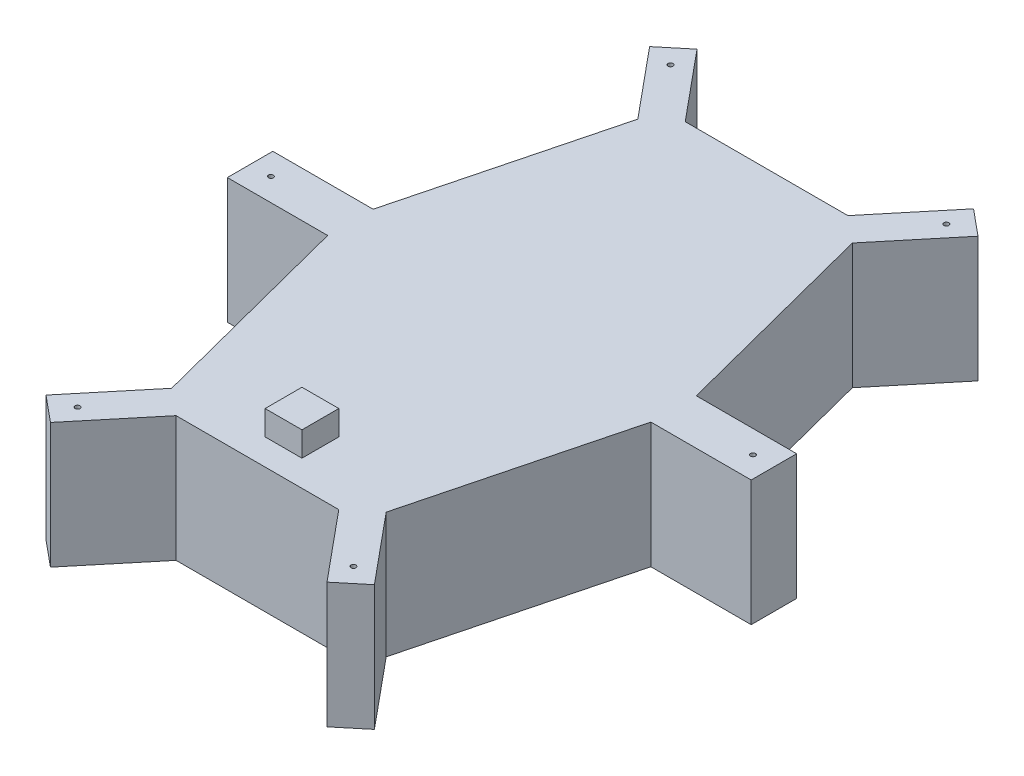
ISO-10303-21;
HEADER;
FILE_DESCRIPTION(('STEP AP214'),'2;1');
FILE_NAME('part.step','',(''),(''),'','','');
FILE_SCHEMA(('AUTOMOTIVE_DESIGN { 1 0 10303 214 1 1 1 1 }'));
ENDSEC;
DATA;
#1=APPLICATION_CONTEXT('core data for automotive mechanical design processes');
#2=APPLICATION_PROTOCOL_DEFINITION('international standard','automotive_design',2000,#1);
#3=PRODUCT_CONTEXT('',#1,'mechanical');
#4=PRODUCT('Part','Part','',(#3));
#5=PRODUCT_RELATED_PRODUCT_CATEGORY('part','',(#4));
#6=PRODUCT_DEFINITION_FORMATION('','',#4);
#7=PRODUCT_DEFINITION_CONTEXT('part definition',#1,'design');
#8=PRODUCT_DEFINITION('design','',#6,#7);
#9=PRODUCT_DEFINITION_SHAPE('','',#8);
#10=(LENGTH_UNIT() NAMED_UNIT(*) SI_UNIT(.MILLI.,.METRE.));
#11=(NAMED_UNIT(*) PLANE_ANGLE_UNIT() SI_UNIT($,.RADIAN.));
#12=(NAMED_UNIT(*) SI_UNIT($,.STERADIAN.) SOLID_ANGLE_UNIT());
#13=UNCERTAINTY_MEASURE_WITH_UNIT(LENGTH_MEASURE(1.E-05),#10,'distance_accuracy_value','');
#14=(GEOMETRIC_REPRESENTATION_CONTEXT(3) GLOBAL_UNCERTAINTY_ASSIGNED_CONTEXT((#13)) GLOBAL_UNIT_ASSIGNED_CONTEXT((#10,
#11,#12)) REPRESENTATION_CONTEXT('',''));
#15=CARTESIAN_POINT('',(0.,0.,0.));
#16=DIRECTION('',(0.,0.,1.));
#17=DIRECTION('',(1.,0.,0.));
#18=AXIS2_PLACEMENT_3D('',#15,#16,#17);
#19=CARTESIAN_POINT('',(-56.259562051727,51.,131.538708790527));
#20=DIRECTION('',(-0.770072992700726,0.,-0.637955786801051));
#21=DIRECTION('',(-0.637955786801051,0.,0.770072992700726));
#22=AXIS2_PLACEMENT_3D('',#19,#20,#21);
#23=PLANE('',#22);
#24=DIRECTION('',(0.63795578680105,0.,-0.770072992700726));
#25=VECTOR('',#24,1.);
#26=CARTESIAN_POINT('',(-56.259562051727,0.,131.538708790527));
#27=LINE('',#26,#25);
#28=CARTESIAN_POINT('',(-56.259562051727,0.,131.538708790527));
#29=VERTEX_POINT('',#28);
#30=CARTESIAN_POINT('',(-33.1,0.,103.582926230358));
#31=VERTEX_POINT('',#30);
#32=EDGE_CURVE('E318',#29,#31,#27,.T.);
#33=ORIENTED_EDGE('',*,*,#32,.T.);
#34=DIRECTION('',(0.,-1.,0.));
#35=VECTOR('',#34,1.);
#36=CARTESIAN_POINT('',(-33.1,51.,103.582926230358));
#37=LINE('',#36,#35);
#38=CARTESIAN_POINT('',(-33.1,51.,103.582926230358));
#39=VERTEX_POINT('',#38);
#40=EDGE_CURVE('E11',#39,#31,#37,.T.);
#41=ORIENTED_EDGE('',*,*,#40,.F.);
#42=DIRECTION('',(0.63795578680105,0.,-0.770072992700726));
#43=VECTOR('',#42,1.);
#44=CARTESIAN_POINT('',(-56.259562051727,51.,131.538708790527));
#45=LINE('',#44,#43);
#46=CARTESIAN_POINT('',(-56.259562051727,51.,131.538708790527));
#47=VERTEX_POINT('',#46);
#48=EDGE_CURVE('E322',#47,#39,#45,.T.);
#49=ORIENTED_EDGE('',*,*,#48,.F.);
#50=DIRECTION('',(0.,-1.,0.));
#51=VECTOR('',#50,1.);
#52=CARTESIAN_POINT('',(-56.259562051727,51.,131.538708790527));
#53=LINE('',#52,#51);
#54=EDGE_CURVE('E405',#47,#29,#53,.T.);
#55=ORIENTED_EDGE('',*,*,#54,.T.);
#56=EDGE_LOOP('',(#33,#41,#49,#55));
#57=FACE_BOUND('',#56,.T.);
#58=ADVANCED_FACE('F39',(#57),#23,.F.);
#59=CARTESIAN_POINT('',(-33.1,51.,103.582926230358));
#60=DIRECTION('',(0.,0.,-1.));
#61=DIRECTION('',(-1.,0.,0.));
#62=AXIS2_PLACEMENT_3D('',#59,#60,#61);
#63=PLANE('',#62);
#64=DIRECTION('',(1.,0.,0.));
#65=VECTOR('',#64,1.);
#66=CARTESIAN_POINT('',(-33.1,0.,103.582926230358));
#67=LINE('',#66,#65);
#68=CARTESIAN_POINT('',(33.1,0.,103.582926230358));
#69=VERTEX_POINT('',#68);
#70=EDGE_CURVE('E409',#31,#69,#67,.T.);
#71=ORIENTED_EDGE('',*,*,#70,.T.);
#72=DIRECTION('',(0.,-1.,0.));
#73=VECTOR('',#72,1.);
#74=CARTESIAN_POINT('',(33.1,51.,103.582926230358));
#75=LINE('',#74,#73);
#76=CARTESIAN_POINT('',(33.1,51.,103.582926230358));
#77=VERTEX_POINT('',#76);
#78=EDGE_CURVE('E47',#77,#69,#75,.T.);
#79=ORIENTED_EDGE('',*,*,#78,.F.);
#80=DIRECTION('',(1.,0.,0.));
#81=VECTOR('',#80,1.);
#82=CARTESIAN_POINT('',(-33.1,51.,103.582926230358));
#83=LINE('',#82,#81);
#84=EDGE_CURVE('E326',#39,#77,#83,.T.);
#85=ORIENTED_EDGE('',*,*,#84,.F.);
#86=ORIENTED_EDGE('',*,*,#40,.T.);
#87=EDGE_LOOP('',(#71,#79,#85,#86));
#88=FACE_BOUND('',#87,.T.);
#89=ADVANCED_FACE('F571',(#88),#63,.F.);
#90=CARTESIAN_POINT('',(56.259562051727,51.,131.538708790527));
#91=DIRECTION('',(-0.770072992700727,0.,0.63795578680105));
#92=DIRECTION('',(0.63795578680105,0.,0.770072992700727));
#93=AXIS2_PLACEMENT_3D('',#90,#91,#92);
#94=PLANE('',#93);
#95=DIRECTION('',(-0.63795578680105,0.,-0.770072992700727));
#96=VECTOR('',#95,1.);
#97=CARTESIAN_POINT('',(56.259562051727,0.,131.538708790527));
#98=LINE('',#97,#96);
#99=CARTESIAN_POINT('',(56.259562051727,0.,131.538708790527));
#100=VERTEX_POINT('',#99);
#101=EDGE_CURVE('E413',#100,#69,#98,.T.);
#102=ORIENTED_EDGE('',*,*,#101,.F.);
#103=DIRECTION('',(0.,-1.,0.));
#104=VECTOR('',#103,1.);
#105=CARTESIAN_POINT('',(56.259562051727,51.,131.538708790527));
#106=LINE('',#105,#104);
#107=CARTESIAN_POINT('',(56.259562051727,51.,131.538708790527));
#108=VERTEX_POINT('',#107);
#109=EDGE_CURVE('E562',#108,#100,#106,.T.);
#110=ORIENTED_EDGE('',*,*,#109,.F.);
#111=DIRECTION('',(-0.63795578680105,0.,-0.770072992700727));
#112=VECTOR('',#111,1.);
#113=CARTESIAN_POINT('',(56.259562051727,51.,131.538708790527));
#114=LINE('',#113,#112);
#115=EDGE_CURVE('E330',#108,#77,#114,.T.);
#116=ORIENTED_EDGE('',*,*,#115,.T.);
#117=ORIENTED_EDGE('',*,*,#78,.T.);
#118=EDGE_LOOP('',(#102,#110,#116,#117));
#119=FACE_BOUND('',#118,.T.);
#120=ADVANCED_FACE('F568',(#119),#94,.T.);
#121=CARTESIAN_POINT('',(66.809562051727,51.,122.798714511353));
#122=DIRECTION('',(0.637955786801052,0.,0.770072992700725));
#123=DIRECTION('',(0.770072992700725,0.,-0.637955786801052));
#124=AXIS2_PLACEMENT_3D('',#121,#122,#123);
#125=PLANE('',#124);
#126=DIRECTION('',(-0.770072992700725,0.,0.637955786801052));
#127=VECTOR('',#126,1.);
#128=CARTESIAN_POINT('',(66.809562051727,0.,122.798714511353));
#129=LINE('',#128,#127);
#130=CARTESIAN_POINT('',(66.809562051727,0.,122.798714511353));
#131=VERTEX_POINT('',#130);
#132=EDGE_CURVE('E417',#131,#100,#129,.T.);
#133=ORIENTED_EDGE('',*,*,#132,.F.);
#134=DIRECTION('',(0.,-1.,0.));
#135=VECTOR('',#134,1.);
#136=CARTESIAN_POINT('',(66.809562051727,51.,122.798714511353));
#137=LINE('',#136,#135);
#138=CARTESIAN_POINT('',(66.809562051727,51.,122.798714511353));
#139=VERTEX_POINT('',#138);
#140=EDGE_CURVE('E559',#139,#131,#137,.T.);
#141=ORIENTED_EDGE('',*,*,#140,.F.);
#142=DIRECTION('',(-0.770072992700725,0.,0.637955786801052));
#143=VECTOR('',#142,1.);
#144=CARTESIAN_POINT('',(66.809562051727,51.,122.798714511353));
#145=LINE('',#144,#143);
#146=EDGE_CURVE('E334',#139,#108,#145,.T.);
#147=ORIENTED_EDGE('',*,*,#146,.T.);
#148=ORIENTED_EDGE('',*,*,#109,.T.);
#149=EDGE_LOOP('',(#133,#141,#147,#148));
#150=FACE_BOUND('',#149,.T.);
#151=ADVANCED_FACE('F580',(#150),#125,.T.);
#152=CARTESIAN_POINT('',(43.65,51.,94.8429319511839));
#153=DIRECTION('',(0.770072992700727,0.,-0.63795578680105));
#154=DIRECTION('',(-0.63795578680105,0.,-0.770072992700727));
#155=AXIS2_PLACEMENT_3D('',#152,#153,#154);
#156=PLANE('',#155);
#157=DIRECTION('',(0.63795578680105,0.,0.770072992700727));
#158=VECTOR('',#157,1.);
#159=CARTESIAN_POINT('',(43.65,0.,94.8429319511839));
#160=LINE('',#159,#158);
#161=CARTESIAN_POINT('',(43.65,0.,94.8429319511839));
#162=VERTEX_POINT('',#161);
#163=EDGE_CURVE('E421',#162,#131,#160,.T.);
#164=ORIENTED_EDGE('',*,*,#163,.F.);
#165=DIRECTION('',(0.,-1.,0.));
#166=VECTOR('',#165,1.);
#167=CARTESIAN_POINT('',(43.65,51.,94.8429319511839));
#168=LINE('',#167,#166);
#169=CARTESIAN_POINT('',(43.65,51.,94.8429319511839));
#170=VERTEX_POINT('',#169);
#171=EDGE_CURVE('E556',#170,#162,#168,.T.);
#172=ORIENTED_EDGE('',*,*,#171,.F.);
#173=DIRECTION('',(0.63795578680105,0.,0.770072992700727));
#174=VECTOR('',#173,1.);
#175=CARTESIAN_POINT('',(43.65,51.,94.8429319511839));
#176=LINE('',#175,#174);
#177=EDGE_CURVE('E338',#170,#139,#176,.T.);
#178=ORIENTED_EDGE('',*,*,#177,.T.);
#179=ORIENTED_EDGE('',*,*,#140,.T.);
#180=EDGE_LOOP('',(#164,#172,#178,#179));
#181=FACE_BOUND('',#180,.T.);
#182=ADVANCED_FACE('F675',(#181),#156,.T.);
#183=CARTESIAN_POINT('',(43.65,51.,94.8429319511839));
#184=DIRECTION('',(-0.968245836551854,0.,-0.25));
#185=DIRECTION('',(-0.25,0.,0.968245836551854));
#186=AXIS2_PLACEMENT_3D('',#183,#184,#185);
#187=PLANE('',#186);
#188=DIRECTION('',(0.25,0.,-0.968245836551854));
#189=VECTOR('',#188,1.);
#190=CARTESIAN_POINT('',(43.65,0.,94.8429319511839));
#191=LINE('',#190,#189);
#192=CARTESIAN_POINT('',(65.75,0.,9.25));
#193=VERTEX_POINT('',#192);
#194=EDGE_CURVE('E425',#162,#193,#191,.T.);
#195=ORIENTED_EDGE('',*,*,#194,.T.);
#196=DIRECTION('',(0.,-1.,0.));
#197=VECTOR('',#196,1.);
#198=CARTESIAN_POINT('',(65.75,51.,9.25));
#199=LINE('',#198,#197);
#200=CARTESIAN_POINT('',(65.75,51.,9.25));
#201=VERTEX_POINT('',#200);
#202=EDGE_CURVE('E552',#201,#193,#199,.T.);
#203=ORIENTED_EDGE('',*,*,#202,.F.);
#204=DIRECTION('',(0.25,0.,-0.968245836551854));
#205=VECTOR('',#204,1.);
#206=CARTESIAN_POINT('',(43.65,51.,94.8429319511839));
#207=LINE('',#206,#205);
#208=EDGE_CURVE('E342',#170,#201,#207,.T.);
#209=ORIENTED_EDGE('',*,*,#208,.F.);
#210=ORIENTED_EDGE('',*,*,#171,.T.);
#211=EDGE_LOOP('',(#195,#203,#209,#210));
#212=FACE_BOUND('',#211,.T.);
#213=ADVANCED_FACE('F673',(#212),#187,.F.);
#214=CARTESIAN_POINT('',(65.75,51.,9.25));
#215=DIRECTION('',(0.,0.,-1.));
#216=DIRECTION('',(-1.,0.,0.));
#217=AXIS2_PLACEMENT_3D('',#214,#215,#216);
#218=PLANE('',#217);
#219=DIRECTION('',(1.,0.,0.));
#220=VECTOR('',#219,1.);
#221=CARTESIAN_POINT('',(65.75,0.,9.25));
#222=LINE('',#221,#220);
#223=CARTESIAN_POINT('',(106.567585168372,0.,9.24999999999997));
#224=VERTEX_POINT('',#223);
#225=EDGE_CURVE('E428',#193,#224,#222,.T.);
#226=ORIENTED_EDGE('',*,*,#225,.T.);
#227=DIRECTION('',(0.,-1.,0.));
#228=VECTOR('',#227,1.);
#229=CARTESIAN_POINT('',(106.567585168372,51.,9.24999999999997));
#230=LINE('',#229,#228);
#231=CARTESIAN_POINT('',(106.567585168372,51.,9.24999999999997));
#232=VERTEX_POINT('',#231);
#233=EDGE_CURVE('E549',#232,#224,#230,.T.);
#234=ORIENTED_EDGE('',*,*,#233,.F.);
#235=DIRECTION('',(1.,0.,0.));
#236=VECTOR('',#235,1.);
#237=CARTESIAN_POINT('',(65.75,51.,9.25));
#238=LINE('',#237,#236);
#239=EDGE_CURVE('E345',#201,#232,#238,.T.);
#240=ORIENTED_EDGE('',*,*,#239,.F.);
#241=ORIENTED_EDGE('',*,*,#202,.T.);
#242=EDGE_LOOP('',(#226,#234,#240,#241));
#243=FACE_BOUND('',#242,.T.);
#244=ADVANCED_FACE('F668',(#243),#218,.F.);
#245=CARTESIAN_POINT('',(106.567585168372,51.,-9.25000000000005));
#246=DIRECTION('',(1.,0.,0.));
#247=DIRECTION('',(0.,0.,-1.));
#248=AXIS2_PLACEMENT_3D('',#245,#246,#247);
#249=PLANE('',#248);
#250=DIRECTION('',(0.,0.,1.));
#251=VECTOR('',#250,1.);
#252=CARTESIAN_POINT('',(106.567585168372,0.,-9.25000000000005));
#253=LINE('',#252,#251);
#254=CARTESIAN_POINT('',(106.567585168372,0.,-9.25000000000005));
#255=VERTEX_POINT('',#254);
#256=EDGE_CURVE('E432',#255,#224,#253,.T.);
#257=ORIENTED_EDGE('',*,*,#256,.F.);
#258=DIRECTION('',(0.,-1.,0.));
#259=VECTOR('',#258,1.);
#260=CARTESIAN_POINT('',(106.567585168372,51.,-9.25000000000005));
#261=LINE('',#260,#259);
#262=CARTESIAN_POINT('',(106.567585168372,51.,-9.25000000000005));
#263=VERTEX_POINT('',#262);
#264=EDGE_CURVE('E546',#263,#255,#261,.T.);
#265=ORIENTED_EDGE('',*,*,#264,.F.);
#266=DIRECTION('',(0.,0.,1.));
#267=VECTOR('',#266,1.);
#268=CARTESIAN_POINT('',(106.567585168372,51.,-9.25000000000005));
#269=LINE('',#268,#267);
#270=EDGE_CURVE('E348',#263,#232,#269,.T.);
#271=ORIENTED_EDGE('',*,*,#270,.T.);
#272=ORIENTED_EDGE('',*,*,#233,.T.);
#273=EDGE_LOOP('',(#257,#265,#271,#272));
#274=FACE_BOUND('',#273,.T.);
#275=ADVANCED_FACE('F664',(#274),#249,.T.);
#276=CARTESIAN_POINT('',(65.75,51.,-9.25000000000002));
#277=DIRECTION('',(0.,0.,-1.));
#278=DIRECTION('',(-1.,0.,0.));
#279=AXIS2_PLACEMENT_3D('',#276,#277,#278);
#280=PLANE('',#279);
#281=DIRECTION('',(1.,0.,0.));
#282=VECTOR('',#281,1.);
#283=CARTESIAN_POINT('',(65.75,0.,-9.25000000000002));
#284=LINE('',#283,#282);
#285=CARTESIAN_POINT('',(65.75,0.,-9.25000000000002));
#286=VERTEX_POINT('',#285);
#287=EDGE_CURVE('E436',#286,#255,#284,.T.);
#288=ORIENTED_EDGE('',*,*,#287,.F.);
#289=DIRECTION('',(0.,-1.,0.));
#290=VECTOR('',#289,1.);
#291=CARTESIAN_POINT('',(65.75,51.,-9.25000000000002));
#292=LINE('',#291,#290);
#293=CARTESIAN_POINT('',(65.75,51.,-9.25000000000002));
#294=VERTEX_POINT('',#293);
#295=EDGE_CURVE('E543',#294,#286,#292,.T.);
#296=ORIENTED_EDGE('',*,*,#295,.F.);
#297=DIRECTION('',(1.,0.,0.));
#298=VECTOR('',#297,1.);
#299=CARTESIAN_POINT('',(65.75,51.,-9.25000000000002));
#300=LINE('',#299,#298);
#301=EDGE_CURVE('E352',#294,#263,#300,.T.);
#302=ORIENTED_EDGE('',*,*,#301,.T.);
#303=ORIENTED_EDGE('',*,*,#264,.T.);
#304=EDGE_LOOP('',(#288,#296,#302,#303));
#305=FACE_BOUND('',#304,.T.);
#306=ADVANCED_FACE('F658',(#305),#280,.T.);
#307=CARTESIAN_POINT('',(65.75,51.,-9.25000000000002));
#308=DIRECTION('',(-0.968245836551854,0.,0.25));
#309=DIRECTION('',(0.25,0.,0.968245836551854));
#310=AXIS2_PLACEMENT_3D('',#307,#308,#309);
#311=PLANE('',#310);
#312=DIRECTION('',(-0.25,0.,-0.968245836551854));
#313=VECTOR('',#312,1.);
#314=CARTESIAN_POINT('',(65.75,0.,-9.25000000000002));
#315=LINE('',#314,#313);
#316=CARTESIAN_POINT('',(43.65,0.,-94.8429319511839));
#317=VERTEX_POINT('',#316);
#318=EDGE_CURVE('E440',#286,#317,#315,.T.);
#319=ORIENTED_EDGE('',*,*,#318,.T.);
#320=DIRECTION('',(0.,-1.,0.));
#321=VECTOR('',#320,1.);
#322=CARTESIAN_POINT('',(43.65,51.,-94.8429319511839));
#323=LINE('',#322,#321);
#324=CARTESIAN_POINT('',(43.65,51.,-94.8429319511839));
#325=VERTEX_POINT('',#324);
#326=EDGE_CURVE('E539',#325,#317,#323,.T.);
#327=ORIENTED_EDGE('',*,*,#326,.F.);
#328=DIRECTION('',(-0.25,0.,-0.968245836551854));
#329=VECTOR('',#328,1.);
#330=CARTESIAN_POINT('',(65.75,51.,-9.25000000000002));
#331=LINE('',#330,#329);
#332=EDGE_CURVE('E356',#294,#325,#331,.T.);
#333=ORIENTED_EDGE('',*,*,#332,.F.);
#334=ORIENTED_EDGE('',*,*,#295,.T.);
#335=EDGE_LOOP('',(#319,#327,#333,#334));
#336=FACE_BOUND('',#335,.T.);
#337=ADVANCED_FACE('F676',(#336),#311,.F.);
#338=CARTESIAN_POINT('',(43.65,51.,-94.8429319511839));
#339=DIRECTION('',(-0.770072992700727,0.,-0.63795578680105));
#340=DIRECTION('',(-0.63795578680105,0.,0.770072992700727));
#341=AXIS2_PLACEMENT_3D('',#338,#339,#340);
#342=PLANE('',#341);
#343=DIRECTION('',(0.637955786801049,0.,-0.770072992700727));
#344=VECTOR('',#343,1.);
#345=CARTESIAN_POINT('',(43.65,0.,-94.8429319511839));
#346=LINE('',#345,#344);
#347=CARTESIAN_POINT('',(66.809562051727,0.,-122.798714511353));
#348=VERTEX_POINT('',#347);
#349=EDGE_CURVE('E443',#317,#348,#346,.T.);
#350=ORIENTED_EDGE('',*,*,#349,.T.);
#351=DIRECTION('',(0.,-1.,0.));
#352=VECTOR('',#351,1.);
#353=CARTESIAN_POINT('',(66.809562051727,51.,-122.798714511353));
#354=LINE('',#353,#352);
#355=CARTESIAN_POINT('',(66.809562051727,51.,-122.798714511353));
#356=VERTEX_POINT('',#355);
#357=EDGE_CURVE('E535',#356,#348,#354,.T.);
#358=ORIENTED_EDGE('',*,*,#357,.F.);
#359=DIRECTION('',(0.637955786801049,0.,-0.770072992700727));
#360=VECTOR('',#359,1.);
#361=CARTESIAN_POINT('',(43.65,51.,-94.8429319511839));
#362=LINE('',#361,#360);
#363=EDGE_CURVE('E359',#325,#356,#362,.T.);
#364=ORIENTED_EDGE('',*,*,#363,.F.);
#365=ORIENTED_EDGE('',*,*,#326,.T.);
#366=EDGE_LOOP('',(#350,#358,#364,#365));
#367=FACE_BOUND('',#366,.T.);
#368=ADVANCED_FACE('F652',(#367),#342,.F.);
#369=CARTESIAN_POINT('',(66.809562051727,51.,-122.798714511353));
#370=DIRECTION('',(-0.637955786801051,0.,0.770072992700726));
#371=DIRECTION('',(0.770072992700726,0.,0.637955786801051));
#372=AXIS2_PLACEMENT_3D('',#369,#370,#371);
#373=PLANE('',#372);
#374=DIRECTION('',(-0.770072992700726,0.,-0.637955786801051));
#375=VECTOR('',#374,1.);
#376=CARTESIAN_POINT('',(66.809562051727,0.,-122.798714511353));
#377=LINE('',#376,#375);
#378=CARTESIAN_POINT('',(56.259562051727,0.,-131.538708790527));
#379=VERTEX_POINT('',#378);
#380=EDGE_CURVE('E446',#348,#379,#377,.T.);
#381=ORIENTED_EDGE('',*,*,#380,.T.);
#382=DIRECTION('',(0.,-1.,0.));
#383=VECTOR('',#382,1.);
#384=CARTESIAN_POINT('',(56.259562051727,51.,-131.538708790527));
#385=LINE('',#384,#383);
#386=CARTESIAN_POINT('',(56.259562051727,51.,-131.538708790527));
#387=VERTEX_POINT('',#386);
#388=EDGE_CURVE('E531',#387,#379,#385,.T.);
#389=ORIENTED_EDGE('',*,*,#388,.F.);
#390=DIRECTION('',(-0.770072992700726,0.,-0.637955786801051));
#391=VECTOR('',#390,1.);
#392=CARTESIAN_POINT('',(66.809562051727,51.,-122.798714511353));
#393=LINE('',#392,#391);
#394=EDGE_CURVE('E362',#356,#387,#393,.T.);
#395=ORIENTED_EDGE('',*,*,#394,.F.);
#396=ORIENTED_EDGE('',*,*,#357,.T.);
#397=EDGE_LOOP('',(#381,#389,#395,#396));
#398=FACE_BOUND('',#397,.T.);
#399=ADVANCED_FACE('F648',(#398),#373,.F.);
#400=CARTESIAN_POINT('',(56.259562051727,51.,-131.538708790527));
#401=DIRECTION('',(0.770072992700726,0.,0.637955786801051));
#402=DIRECTION('',(0.637955786801051,0.,-0.770072992700726));
#403=AXIS2_PLACEMENT_3D('',#400,#401,#402);
#404=PLANE('',#403);
#405=DIRECTION('',(-0.63795578680105,0.,0.770072992700726));
#406=VECTOR('',#405,1.);
#407=CARTESIAN_POINT('',(56.259562051727,0.,-131.538708790527));
#408=LINE('',#407,#406);
#409=CARTESIAN_POINT('',(33.1,0.,-103.582926230358));
#410=VERTEX_POINT('',#409);
#411=EDGE_CURVE('E449',#379,#410,#408,.T.);
#412=ORIENTED_EDGE('',*,*,#411,.T.);
#413=DIRECTION('',(0.,-1.,0.));
#414=VECTOR('',#413,1.);
#415=CARTESIAN_POINT('',(33.1,51.,-103.582926230358));
#416=LINE('',#415,#414);
#417=CARTESIAN_POINT('',(33.1,51.,-103.582926230358));
#418=VERTEX_POINT('',#417);
#419=EDGE_CURVE('E527',#418,#410,#416,.T.);
#420=ORIENTED_EDGE('',*,*,#419,.F.);
#421=DIRECTION('',(-0.63795578680105,0.,0.770072992700726));
#422=VECTOR('',#421,1.);
#423=CARTESIAN_POINT('',(56.259562051727,51.,-131.538708790527));
#424=LINE('',#423,#422);
#425=EDGE_CURVE('E365',#387,#418,#424,.T.);
#426=ORIENTED_EDGE('',*,*,#425,.F.);
#427=ORIENTED_EDGE('',*,*,#388,.T.);
#428=EDGE_LOOP('',(#412,#420,#426,#427));
#429=FACE_BOUND('',#428,.T.);
#430=ADVANCED_FACE('F643',(#429),#404,.F.);
#431=CARTESIAN_POINT('',(33.1,51.,-103.582926230358));
#432=DIRECTION('',(0.,0.,1.));
#433=DIRECTION('',(1.,0.,0.));
#434=AXIS2_PLACEMENT_3D('',#431,#432,#433);
#435=PLANE('',#434);
#436=DIRECTION('',(-1.,0.,0.));
#437=VECTOR('',#436,1.);
#438=CARTESIAN_POINT('',(33.1,0.,-103.582926230358));
#439=LINE('',#438,#437);
#440=CARTESIAN_POINT('',(-33.1,0.,-103.582926230358));
#441=VERTEX_POINT('',#440);
#442=EDGE_CURVE('E452',#410,#441,#439,.T.);
#443=ORIENTED_EDGE('',*,*,#442,.T.);
#444=DIRECTION('',(0.,-1.,0.));
#445=VECTOR('',#444,1.);
#446=CARTESIAN_POINT('',(-33.1,51.,-103.582926230358));
#447=LINE('',#446,#445);
#448=CARTESIAN_POINT('',(-33.1,51.,-103.582926230358));
#449=VERTEX_POINT('',#448);
#450=EDGE_CURVE('E524',#449,#441,#447,.T.);
#451=ORIENTED_EDGE('',*,*,#450,.F.);
#452=DIRECTION('',(-1.,0.,0.));
#453=VECTOR('',#452,1.);
#454=CARTESIAN_POINT('',(33.1,51.,-103.582926230358));
#455=LINE('',#454,#453);
#456=EDGE_CURVE('E368',#418,#449,#455,.T.);
#457=ORIENTED_EDGE('',*,*,#456,.F.);
#458=ORIENTED_EDGE('',*,*,#419,.T.);
#459=EDGE_LOOP('',(#443,#451,#457,#458));
#460=FACE_BOUND('',#459,.T.);
#461=ADVANCED_FACE('F637',(#460),#435,.F.);
#462=CARTESIAN_POINT('',(-56.259562051727,51.,-131.538708790527));
#463=DIRECTION('',(0.770072992700726,0.,-0.637955786801051));
#464=DIRECTION('',(-0.637955786801051,0.,-0.770072992700726));
#465=AXIS2_PLACEMENT_3D('',#462,#463,#464);
#466=PLANE('',#465);
#467=DIRECTION('',(0.63795578680105,0.,0.770072992700726));
#468=VECTOR('',#467,1.);
#469=CARTESIAN_POINT('',(-56.259562051727,0.,-131.538708790527));
#470=LINE('',#469,#468);
#471=CARTESIAN_POINT('',(-56.259562051727,0.,-131.538708790527));
#472=VERTEX_POINT('',#471);
#473=EDGE_CURVE('E456',#472,#441,#470,.T.);
#474=ORIENTED_EDGE('',*,*,#473,.F.);
#475=DIRECTION('',(0.,-1.,0.));
#476=VECTOR('',#475,1.);
#477=CARTESIAN_POINT('',(-56.259562051727,51.,-131.538708790527));
#478=LINE('',#477,#476);
#479=CARTESIAN_POINT('',(-56.259562051727,51.,-131.538708790527));
#480=VERTEX_POINT('',#479);
#481=EDGE_CURVE('E521',#480,#472,#478,.T.);
#482=ORIENTED_EDGE('',*,*,#481,.F.);
#483=DIRECTION('',(0.63795578680105,0.,0.770072992700726));
#484=VECTOR('',#483,1.);
#485=CARTESIAN_POINT('',(-56.259562051727,51.,-131.538708790527));
#486=LINE('',#485,#484);
#487=EDGE_CURVE('E371',#480,#449,#486,.T.);
#488=ORIENTED_EDGE('',*,*,#487,.T.);
#489=ORIENTED_EDGE('',*,*,#450,.T.);
#490=EDGE_LOOP('',(#474,#482,#488,#489));
#491=FACE_BOUND('',#490,.T.);
#492=ADVANCED_FACE('F633',(#491),#466,.T.);
#493=CARTESIAN_POINT('',(-66.809562051727,51.,-122.798714511353));
#494=DIRECTION('',(-0.63795578680105,0.,-0.770072992700726));
#495=DIRECTION('',(-0.770072992700726,0.,0.63795578680105));
#496=AXIS2_PLACEMENT_3D('',#493,#494,#495);
#497=PLANE('',#496);
#498=DIRECTION('',(0.770072992700726,0.,-0.63795578680105));
#499=VECTOR('',#498,1.);
#500=CARTESIAN_POINT('',(-66.809562051727,0.,-122.798714511353));
#501=LINE('',#500,#499);
#502=CARTESIAN_POINT('',(-66.809562051727,0.,-122.798714511353));
#503=VERTEX_POINT('',#502);
#504=EDGE_CURVE('E460',#503,#472,#501,.T.);
#505=ORIENTED_EDGE('',*,*,#504,.F.);
#506=DIRECTION('',(0.,-1.,0.));
#507=VECTOR('',#506,1.);
#508=CARTESIAN_POINT('',(-66.809562051727,51.,-122.798714511353));
#509=LINE('',#508,#507);
#510=CARTESIAN_POINT('',(-66.809562051727,51.,-122.798714511353));
#511=VERTEX_POINT('',#510);
#512=EDGE_CURVE('E518',#511,#503,#509,.T.);
#513=ORIENTED_EDGE('',*,*,#512,.F.);
#514=DIRECTION('',(0.770072992700726,0.,-0.63795578680105));
#515=VECTOR('',#514,1.);
#516=CARTESIAN_POINT('',(-66.809562051727,51.,-122.798714511353));
#517=LINE('',#516,#515);
#518=EDGE_CURVE('E375',#511,#480,#517,.T.);
#519=ORIENTED_EDGE('',*,*,#518,.T.);
#520=ORIENTED_EDGE('',*,*,#481,.T.);
#521=EDGE_LOOP('',(#505,#513,#519,#520));
#522=FACE_BOUND('',#521,.T.);
#523=ADVANCED_FACE('F629',(#522),#497,.T.);
#524=CARTESIAN_POINT('',(-43.65,51.,-94.8429319511839));
#525=DIRECTION('',(-0.770072992700727,0.,0.63795578680105));
#526=DIRECTION('',(0.63795578680105,0.,0.770072992700727));
#527=AXIS2_PLACEMENT_3D('',#524,#525,#526);
#528=PLANE('',#527);
#529=DIRECTION('',(-0.63795578680105,0.,-0.770072992700726));
#530=VECTOR('',#529,1.);
#531=CARTESIAN_POINT('',(-43.65,0.,-94.8429319511839));
#532=LINE('',#531,#530);
#533=CARTESIAN_POINT('',(-43.65,0.,-94.8429319511839));
#534=VERTEX_POINT('',#533);
#535=EDGE_CURVE('E464',#534,#503,#532,.T.);
#536=ORIENTED_EDGE('',*,*,#535,.F.);
#537=DIRECTION('',(0.,-1.,0.));
#538=VECTOR('',#537,1.);
#539=CARTESIAN_POINT('',(-43.65,51.,-94.8429319511839));
#540=LINE('',#539,#538);
#541=CARTESIAN_POINT('',(-43.65,51.,-94.8429319511839));
#542=VERTEX_POINT('',#541);
#543=EDGE_CURVE('E515',#542,#534,#540,.T.);
#544=ORIENTED_EDGE('',*,*,#543,.F.);
#545=DIRECTION('',(-0.63795578680105,0.,-0.770072992700726));
#546=VECTOR('',#545,1.);
#547=CARTESIAN_POINT('',(-43.65,51.,-94.8429319511839));
#548=LINE('',#547,#546);
#549=EDGE_CURVE('E379',#542,#511,#548,.T.);
#550=ORIENTED_EDGE('',*,*,#549,.T.);
#551=ORIENTED_EDGE('',*,*,#512,.T.);
#552=EDGE_LOOP('',(#536,#544,#550,#551));
#553=FACE_BOUND('',#552,.T.);
#554=ADVANCED_FACE('F624',(#553),#528,.T.);
#555=CARTESIAN_POINT('',(-43.65,51.,-94.8429319511839));
#556=DIRECTION('',(0.968245836551854,0.,0.25));
#557=DIRECTION('',(0.25,0.,-0.968245836551854));
#558=AXIS2_PLACEMENT_3D('',#555,#556,#557);
#559=PLANE('',#558);
#560=DIRECTION('',(-0.25,0.,0.968245836551854));
#561=VECTOR('',#560,1.);
#562=CARTESIAN_POINT('',(-43.65,0.,-94.8429319511839));
#563=LINE('',#562,#561);
#564=CARTESIAN_POINT('',(-65.75,0.,-9.25000000000002));
#565=VERTEX_POINT('',#564);
#566=EDGE_CURVE('E468',#534,#565,#563,.T.);
#567=ORIENTED_EDGE('',*,*,#566,.T.);
#568=DIRECTION('',(0.,-1.,0.));
#569=VECTOR('',#568,1.);
#570=CARTESIAN_POINT('',(-65.75,51.,-9.25000000000002));
#571=LINE('',#570,#569);
#572=CARTESIAN_POINT('',(-65.75,51.,-9.25000000000002));
#573=VERTEX_POINT('',#572);
#574=EDGE_CURVE('E511',#573,#565,#571,.T.);
#575=ORIENTED_EDGE('',*,*,#574,.F.);
#576=DIRECTION('',(-0.25,0.,0.968245836551854));
#577=VECTOR('',#576,1.);
#578=CARTESIAN_POINT('',(-43.65,51.,-94.8429319511839));
#579=LINE('',#578,#577);
#580=EDGE_CURVE('E383',#542,#573,#579,.T.);
#581=ORIENTED_EDGE('',*,*,#580,.F.);
#582=ORIENTED_EDGE('',*,*,#543,.T.);
#583=EDGE_LOOP('',(#567,#575,#581,#582));
#584=FACE_BOUND('',#583,.T.);
#585=ADVANCED_FACE('F621',(#584),#559,.F.);
#586=CARTESIAN_POINT('',(-65.75,51.,-9.25000000000002));
#587=DIRECTION('',(0.,0.,1.));
#588=DIRECTION('',(1.,0.,0.));
#589=AXIS2_PLACEMENT_3D('',#586,#587,#588);
#590=PLANE('',#589);
#591=DIRECTION('',(-1.,0.,0.));
#592=VECTOR('',#591,1.);
#593=CARTESIAN_POINT('',(-65.75,0.,-9.25000000000002));
#594=LINE('',#593,#592);
#595=CARTESIAN_POINT('',(-106.567585168372,0.,-9.25000000000002));
#596=VERTEX_POINT('',#595);
#597=EDGE_CURVE('E471',#565,#596,#594,.T.);
#598=ORIENTED_EDGE('',*,*,#597,.T.);
#599=DIRECTION('',(0.,-1.,0.));
#600=VECTOR('',#599,1.);
#601=CARTESIAN_POINT('',(-106.567585168372,51.,-9.25000000000002));
#602=LINE('',#601,#600);
#603=CARTESIAN_POINT('',(-106.567585168372,51.,-9.25000000000002));
#604=VERTEX_POINT('',#603);
#605=EDGE_CURVE('E507',#604,#596,#602,.T.);
#606=ORIENTED_EDGE('',*,*,#605,.F.);
#607=DIRECTION('',(-1.,0.,0.));
#608=VECTOR('',#607,1.);
#609=CARTESIAN_POINT('',(-65.75,51.,-9.25000000000002));
#610=LINE('',#609,#608);
#611=EDGE_CURVE('E386',#573,#604,#610,.T.);
#612=ORIENTED_EDGE('',*,*,#611,.F.);
#613=ORIENTED_EDGE('',*,*,#574,.T.);
#614=EDGE_LOOP('',(#598,#606,#612,#613));
#615=FACE_BOUND('',#614,.T.);
#616=ADVANCED_FACE('F616',(#615),#590,.F.);
#617=CARTESIAN_POINT('',(-106.567585168372,51.,-9.25000000000002));
#618=DIRECTION('',(1.,0.,0.));
#619=DIRECTION('',(0.,0.,-1.));
#620=AXIS2_PLACEMENT_3D('',#617,#618,#619);
#621=PLANE('',#620);
#622=DIRECTION('',(0.,0.,1.));
#623=VECTOR('',#622,1.);
#624=CARTESIAN_POINT('',(-106.567585168372,0.,-9.25000000000002));
#625=LINE('',#624,#623);
#626=CARTESIAN_POINT('',(-106.567585168372,0.,9.25));
#627=VERTEX_POINT('',#626);
#628=EDGE_CURVE('E474',#596,#627,#625,.T.);
#629=ORIENTED_EDGE('',*,*,#628,.T.);
#630=DIRECTION('',(0.,-1.,0.));
#631=VECTOR('',#630,1.);
#632=CARTESIAN_POINT('',(-106.567585168372,51.,9.25));
#633=LINE('',#632,#631);
#634=CARTESIAN_POINT('',(-106.567585168372,51.,9.25));
#635=VERTEX_POINT('',#634);
#636=EDGE_CURVE('E504',#635,#627,#633,.T.);
#637=ORIENTED_EDGE('',*,*,#636,.F.);
#638=DIRECTION('',(0.,0.,1.));
#639=VECTOR('',#638,1.);
#640=CARTESIAN_POINT('',(-106.567585168372,51.,-9.25000000000002));
#641=LINE('',#640,#639);
#642=EDGE_CURVE('E389',#604,#635,#641,.T.);
#643=ORIENTED_EDGE('',*,*,#642,.F.);
#644=ORIENTED_EDGE('',*,*,#605,.T.);
#645=EDGE_LOOP('',(#629,#637,#643,#644));
#646=FACE_BOUND('',#645,.T.);
#647=ADVANCED_FACE('F610',(#646),#621,.F.);
#648=CARTESIAN_POINT('',(-65.75,51.,9.25));
#649=DIRECTION('',(0.,0.,1.));
#650=DIRECTION('',(1.,0.,0.));
#651=AXIS2_PLACEMENT_3D('',#648,#649,#650);
#652=PLANE('',#651);
#653=DIRECTION('',(-1.,0.,0.));
#654=VECTOR('',#653,1.);
#655=CARTESIAN_POINT('',(-65.75,0.,9.25));
#656=LINE('',#655,#654);
#657=CARTESIAN_POINT('',(-65.75,0.,9.25));
#658=VERTEX_POINT('',#657);
#659=EDGE_CURVE('E478',#658,#627,#656,.T.);
#660=ORIENTED_EDGE('',*,*,#659,.F.);
#661=DIRECTION('',(0.,-1.,0.));
#662=VECTOR('',#661,1.);
#663=CARTESIAN_POINT('',(-65.75,51.,9.25));
#664=LINE('',#663,#662);
#665=CARTESIAN_POINT('',(-65.75,51.,9.25));
#666=VERTEX_POINT('',#665);
#667=EDGE_CURVE('E501',#666,#658,#664,.T.);
#668=ORIENTED_EDGE('',*,*,#667,.F.);
#669=DIRECTION('',(-1.,0.,0.));
#670=VECTOR('',#669,1.);
#671=CARTESIAN_POINT('',(-65.75,51.,9.25));
#672=LINE('',#671,#670);
#673=EDGE_CURVE('E392',#666,#635,#672,.T.);
#674=ORIENTED_EDGE('',*,*,#673,.T.);
#675=ORIENTED_EDGE('',*,*,#636,.T.);
#676=EDGE_LOOP('',(#660,#668,#674,#675));
#677=FACE_BOUND('',#676,.T.);
#678=ADVANCED_FACE('F606',(#677),#652,.T.);
#679=CARTESIAN_POINT('',(-65.75,51.,9.25));
#680=DIRECTION('',(0.968245836551854,0.,-0.25));
#681=DIRECTION('',(-0.25,0.,-0.968245836551854));
#682=AXIS2_PLACEMENT_3D('',#679,#680,#681);
#683=PLANE('',#682);
#684=DIRECTION('',(0.25,0.,0.968245836551854));
#685=VECTOR('',#684,1.);
#686=CARTESIAN_POINT('',(-65.75,0.,9.25));
#687=LINE('',#686,#685);
#688=CARTESIAN_POINT('',(-43.65,0.,94.8429319511839));
#689=VERTEX_POINT('',#688);
#690=EDGE_CURVE('E482',#658,#689,#687,.T.);
#691=ORIENTED_EDGE('',*,*,#690,.T.);
#692=DIRECTION('',(0.,-1.,0.));
#693=VECTOR('',#692,1.);
#694=CARTESIAN_POINT('',(-43.65,51.,94.8429319511839));
#695=LINE('',#694,#693);
#696=CARTESIAN_POINT('',(-43.65,51.,94.8429319511839));
#697=VERTEX_POINT('',#696);
#698=EDGE_CURVE('E497',#697,#689,#695,.T.);
#699=ORIENTED_EDGE('',*,*,#698,.F.);
#700=DIRECTION('',(0.25,0.,0.968245836551854));
#701=VECTOR('',#700,1.);
#702=CARTESIAN_POINT('',(-65.75,51.,9.25));
#703=LINE('',#702,#701);
#704=EDGE_CURVE('E396',#666,#697,#703,.T.);
#705=ORIENTED_EDGE('',*,*,#704,.F.);
#706=ORIENTED_EDGE('',*,*,#667,.T.);
#707=EDGE_LOOP('',(#691,#699,#705,#706));
#708=FACE_BOUND('',#707,.T.);
#709=ADVANCED_FACE('F601',(#708),#683,.F.);
#710=CARTESIAN_POINT('',(-43.65,51.,94.8429319511839));
#711=DIRECTION('',(0.770072992700726,0.,0.63795578680105));
#712=DIRECTION('',(0.63795578680105,0.,-0.770072992700726));
#713=AXIS2_PLACEMENT_3D('',#710,#711,#712);
#714=PLANE('',#713);
#715=DIRECTION('',(-0.63795578680105,0.,0.770072992700726));
#716=VECTOR('',#715,1.);
#717=CARTESIAN_POINT('',(-43.65,0.,94.8429319511839));
#718=LINE('',#717,#716);
#719=CARTESIAN_POINT('',(-66.809562051727,0.,122.798714511353));
#720=VERTEX_POINT('',#719);
#721=EDGE_CURVE('E485',#689,#720,#718,.T.);
#722=ORIENTED_EDGE('',*,*,#721,.T.);
#723=DIRECTION('',(0.,-1.,0.));
#724=VECTOR('',#723,1.);
#725=CARTESIAN_POINT('',(-66.809562051727,51.,122.798714511353));
#726=LINE('',#725,#724);
#727=CARTESIAN_POINT('',(-66.809562051727,51.,122.798714511353));
#728=VERTEX_POINT('',#727);
#729=EDGE_CURVE('E493',#728,#720,#726,.T.);
#730=ORIENTED_EDGE('',*,*,#729,.F.);
#731=DIRECTION('',(-0.63795578680105,0.,0.770072992700726));
#732=VECTOR('',#731,1.);
#733=CARTESIAN_POINT('',(-43.65,51.,94.8429319511839));
#734=LINE('',#733,#732);
#735=EDGE_CURVE('E399',#697,#728,#734,.T.);
#736=ORIENTED_EDGE('',*,*,#735,.F.);
#737=ORIENTED_EDGE('',*,*,#698,.T.);
#738=EDGE_LOOP('',(#722,#730,#736,#737));
#739=FACE_BOUND('',#738,.T.);
#740=ADVANCED_FACE('F597',(#739),#714,.F.);
#741=CARTESIAN_POINT('',(-66.809562051727,51.,122.798714511353));
#742=DIRECTION('',(0.637955786801051,0.,-0.770072992700725));
#743=DIRECTION('',(-0.770072992700725,0.,-0.637955786801051));
#744=AXIS2_PLACEMENT_3D('',#741,#742,#743);
#745=PLANE('',#744);
#746=DIRECTION('',(0.770072992700725,0.,0.637955786801051));
#747=VECTOR('',#746,1.);
#748=CARTESIAN_POINT('',(-66.809562051727,0.,122.798714511353));
#749=LINE('',#748,#747);
#750=EDGE_CURVE('E327',#720,#29,#749,.T.);
#751=ORIENTED_EDGE('',*,*,#750,.T.);
#752=ORIENTED_EDGE('',*,*,#54,.F.);
#753=DIRECTION('',(0.770072992700725,0.,0.637955786801051));
#754=VECTOR('',#753,1.);
#755=CARTESIAN_POINT('',(-66.809562051727,51.,122.798714511353));
#756=LINE('',#755,#754);
#757=EDGE_CURVE('E402',#728,#47,#756,.T.);
#758=ORIENTED_EDGE('',*,*,#757,.F.);
#759=ORIENTED_EDGE('',*,*,#729,.T.);
#760=EDGE_LOOP('',(#751,#752,#758,#759));
#761=FACE_BOUND('',#760,.T.);
#762=ADVANCED_FACE('F593',(#761),#745,.F.);
#763=CARTESIAN_POINT('',(0.,51.,0.));
#764=DIRECTION('',(0.,1.,0.));
#765=DIRECTION('',(0.,0.,1.));
#766=AXIS2_PLACEMENT_3D('',#763,#764,#765);
#767=PLANE('',#766);
#768=DIRECTION('',(0.,0.,1.));
#769=VECTOR('',#768,1.);
#770=CARTESIAN_POINT('',(7.50000000000001,51.,77.962689847794));
#771=LINE('',#770,#769);
#772=CARTESIAN_POINT('',(7.50000000000001,51.,77.962689847794));
#773=VERTEX_POINT('',#772);
#774=CARTESIAN_POINT('',(7.50000000000001,51.,92.962689847794));
#775=VERTEX_POINT('',#774);
#776=EDGE_CURVE('E259',#773,#775,#771,.T.);
#777=ORIENTED_EDGE('',*,*,#776,.T.);
#778=DIRECTION('',(-1.,0.,0.));
#779=VECTOR('',#778,1.);
#780=CARTESIAN_POINT('',(-7.49999999999999,51.,92.962689847794));
#781=LINE('',#780,#779);
#782=CARTESIAN_POINT('',(-7.49999999999999,51.,92.962689847794));
#783=VERTEX_POINT('',#782);
#784=EDGE_CURVE('E229',#775,#783,#781,.T.);
#785=ORIENTED_EDGE('',*,*,#784,.T.);
#786=DIRECTION('',(0.,0.,-1.));
#787=VECTOR('',#786,1.);
#788=CARTESIAN_POINT('',(-7.49999999999999,51.,77.962689847794));
#789=LINE('',#788,#787);
#790=CARTESIAN_POINT('',(-7.49999999999999,51.,77.962689847794));
#791=VERTEX_POINT('',#790);
#792=EDGE_CURVE('E59',#783,#791,#789,.T.);
#793=ORIENTED_EDGE('',*,*,#792,.T.);
#794=DIRECTION('',(1.,0.,0.));
#795=VECTOR('',#794,1.);
#796=CARTESIAN_POINT('',(-7.49999999999999,51.,77.962689847794));
#797=LINE('',#796,#795);
#798=EDGE_CURVE('E54',#791,#773,#797,.T.);
#799=ORIENTED_EDGE('',*,*,#798,.T.);
#800=EDGE_LOOP('',(#777,#785,#793,#799));
#801=FACE_BOUND('',#800,.T.);
#802=CARTESIAN_POINT('',(-56.1119378639181,51.,-120.623091212984));
#803=DIRECTION('',(0.,1.,0.));
#804=DIRECTION('',(0.,0.,1.));
#805=AXIS2_PLACEMENT_3D('',#802,#803,#804);
#806=CIRCLE('',#805,0.999999999999992);
#807=CARTESIAN_POINT('',(-56.1119378639181,51.,-119.623091212984));
#808=VERTEX_POINT('',#807);
#809=EDGE_CURVE('E268',#808,#808,#806,.F.);
#810=ORIENTED_EDGE('',*,*,#809,.T.);
#811=EDGE_LOOP('',(#810));
#812=FACE_BOUND('',#811,.T.);
#813=CARTESIAN_POINT('',(56.1119378639181,51.,-120.623091212984));
#814=DIRECTION('',(0.,1.,0.));
#815=DIRECTION('',(0.,0.,1.));
#816=AXIS2_PLACEMENT_3D('',#813,#814,#815);
#817=CIRCLE('',#816,0.999999999999992);
#818=CARTESIAN_POINT('',(56.1119378639181,51.,-119.623091212984));
#819=VERTEX_POINT('',#818);
#820=EDGE_CURVE('E285',#819,#819,#817,.T.);
#821=ORIENTED_EDGE('',*,*,#820,.F.);
#822=EDGE_LOOP('',(#821));
#823=FACE_BOUND('',#822,.T.);
#824=CARTESIAN_POINT('',(-56.1119378639181,51.,120.623091212984));
#825=DIRECTION('',(0.,1.,0.));
#826=DIRECTION('',(0.,0.,1.));
#827=AXIS2_PLACEMENT_3D('',#824,#825,#826);
#828=CIRCLE('',#827,0.999999999999992);
#829=CARTESIAN_POINT('',(-56.1119378639181,51.,121.623091212984));
#830=VERTEX_POINT('',#829);
#831=EDGE_CURVE('E293',#830,#830,#828,.T.);
#832=ORIENTED_EDGE('',*,*,#831,.F.);
#833=EDGE_LOOP('',(#832));
#834=FACE_BOUND('',#833,.T.);
#835=CARTESIAN_POINT('',(56.1119378639181,51.,120.623091212984));
#836=DIRECTION('',(0.,1.,0.));
#837=DIRECTION('',(0.,0.,1.));
#838=AXIS2_PLACEMENT_3D('',#835,#836,#837);
#839=CIRCLE('',#838,0.999999999999992);
#840=CARTESIAN_POINT('',(56.1119378639181,51.,121.623091212984));
#841=VERTEX_POINT('',#840);
#842=EDGE_CURVE('E297',#841,#841,#839,.F.);
#843=ORIENTED_EDGE('',*,*,#842,.T.);
#844=EDGE_LOOP('',(#843));
#845=FACE_BOUND('',#844,.T.);
#846=CARTESIAN_POINT('',(-98.0675851683724,51.,0.));
#847=DIRECTION('',(0.,1.,0.));
#848=DIRECTION('',(0.,0.,1.));
#849=AXIS2_PLACEMENT_3D('',#846,#847,#848);
#850=CIRCLE('',#849,0.999999999999998);
#851=CARTESIAN_POINT('',(-98.0675851683724,51.,0.999999999999986));
#852=VERTEX_POINT('',#851);
#853=EDGE_CURVE('E309',#852,#852,#850,.T.);
#854=ORIENTED_EDGE('',*,*,#853,.F.);
#855=EDGE_LOOP('',(#854));
#856=FACE_BOUND('',#855,.T.);
#857=CARTESIAN_POINT('',(98.0675851683724,51.,0.));
#858=DIRECTION('',(0.,1.,0.));
#859=DIRECTION('',(0.,0.,1.));
#860=AXIS2_PLACEMENT_3D('',#857,#858,#859);
#861=CIRCLE('',#860,0.999999999999998);
#862=CARTESIAN_POINT('',(98.0675851683724,51.,0.999999999999986));
#863=VERTEX_POINT('',#862);
#864=EDGE_CURVE('E313',#863,#863,#861,.F.);
#865=ORIENTED_EDGE('',*,*,#864,.T.);
#866=EDGE_LOOP('',(#865));
#867=FACE_BOUND('',#866,.T.);
#868=ORIENTED_EDGE('',*,*,#48,.T.);
#869=ORIENTED_EDGE('',*,*,#84,.T.);
#870=ORIENTED_EDGE('',*,*,#115,.F.);
#871=ORIENTED_EDGE('',*,*,#146,.F.);
#872=ORIENTED_EDGE('',*,*,#177,.F.);
#873=ORIENTED_EDGE('',*,*,#208,.T.);
#874=ORIENTED_EDGE('',*,*,#239,.T.);
#875=ORIENTED_EDGE('',*,*,#270,.F.);
#876=ORIENTED_EDGE('',*,*,#301,.F.);
#877=ORIENTED_EDGE('',*,*,#332,.T.);
#878=ORIENTED_EDGE('',*,*,#363,.T.);
#879=ORIENTED_EDGE('',*,*,#394,.T.);
#880=ORIENTED_EDGE('',*,*,#425,.T.);
#881=ORIENTED_EDGE('',*,*,#456,.T.);
#882=ORIENTED_EDGE('',*,*,#487,.F.);
#883=ORIENTED_EDGE('',*,*,#518,.F.);
#884=ORIENTED_EDGE('',*,*,#549,.F.);
#885=ORIENTED_EDGE('',*,*,#580,.T.);
#886=ORIENTED_EDGE('',*,*,#611,.T.);
#887=ORIENTED_EDGE('',*,*,#642,.T.);
#888=ORIENTED_EDGE('',*,*,#673,.F.);
#889=ORIENTED_EDGE('',*,*,#704,.T.);
#890=ORIENTED_EDGE('',*,*,#735,.T.);
#891=ORIENTED_EDGE('',*,*,#757,.T.);
#892=EDGE_LOOP('',(#868,#869,#870,#871,#872,#873,#874,#875,#876,#877,#878,#879,#880,#881,#882,
#883,#884,#885,#886,#887,#888,#889,#890,#891));
#893=FACE_BOUND('',#892,.T.);
#894=ADVANCED_FACE('F583',(#801,#812,#823,#834,#845,#856,#867,#893),#767,.T.);
#895=CARTESIAN_POINT('',(0.,0.,0.));
#896=DIRECTION('',(0.,1.,0.));
#897=DIRECTION('',(0.,0.,1.));
#898=AXIS2_PLACEMENT_3D('',#895,#896,#897);
#899=PLANE('',#898);
#900=CARTESIAN_POINT('',(-56.1119378639181,0.,-120.623091212984));
#901=DIRECTION('',(0.,-1.,0.));
#902=DIRECTION('',(0.,0.,1.));
#903=AXIS2_PLACEMENT_3D('',#900,#901,#902);
#904=CIRCLE('',#903,0.999999999999992);
#905=CARTESIAN_POINT('',(-56.1119378639181,0.,-119.623091212984));
#906=VERTEX_POINT('',#905);
#907=EDGE_CURVE('E274',#906,#906,#904,.T.);
#908=ORIENTED_EDGE('',*,*,#907,.F.);
#909=EDGE_LOOP('',(#908));
#910=FACE_BOUND('',#909,.T.);
#911=CARTESIAN_POINT('',(56.1119378639181,0.,-120.623091212984));
#912=DIRECTION('',(0.,1.,0.));
#913=DIRECTION('',(0.,0.,1.));
#914=AXIS2_PLACEMENT_3D('',#911,#912,#913);
#915=CIRCLE('',#914,0.999999999999992);
#916=CARTESIAN_POINT('',(56.1119378639181,0.,-119.623091212984));
#917=VERTEX_POINT('',#916);
#918=EDGE_CURVE('E278',#917,#917,#915,.T.);
#919=ORIENTED_EDGE('',*,*,#918,.T.);
#920=EDGE_LOOP('',(#919));
#921=FACE_BOUND('',#920,.T.);
#922=CARTESIAN_POINT('',(-56.1119378639181,0.,120.623091212984));
#923=DIRECTION('',(0.,1.,0.));
#924=DIRECTION('',(0.,0.,-1.));
#925=AXIS2_PLACEMENT_3D('',#922,#923,#924);
#926=CIRCLE('',#925,0.999999999999992);
#927=CARTESIAN_POINT('',(-56.1119378639181,0.,119.623091212984));
#928=VERTEX_POINT('',#927);
#929=EDGE_CURVE('E289',#928,#928,#926,.T.);
#930=ORIENTED_EDGE('',*,*,#929,.T.);
#931=EDGE_LOOP('',(#930));
#932=FACE_BOUND('',#931,.T.);
#933=CARTESIAN_POINT('',(56.1119378639181,0.,120.623091212984));
#934=DIRECTION('',(0.,-1.,0.));
#935=DIRECTION('',(0.,0.,-1.));
#936=AXIS2_PLACEMENT_3D('',#933,#934,#935);
#937=CIRCLE('',#936,0.999999999999992);
#938=CARTESIAN_POINT('',(56.1119378639181,0.,119.623091212984));
#939=VERTEX_POINT('',#938);
#940=EDGE_CURVE('E298',#939,#939,#937,.T.);
#941=ORIENTED_EDGE('',*,*,#940,.F.);
#942=EDGE_LOOP('',(#941));
#943=FACE_BOUND('',#942,.T.);
#944=CARTESIAN_POINT('',(-98.0675851683724,0.,0.));
#945=DIRECTION('',(0.,1.,0.));
#946=DIRECTION('',(0.,0.,-1.));
#947=AXIS2_PLACEMENT_3D('',#944,#945,#946);
#948=CIRCLE('',#947,0.999999999999998);
#949=CARTESIAN_POINT('',(-98.0675851683724,0.,-1.00000000000001));
#950=VERTEX_POINT('',#949);
#951=EDGE_CURVE('E302',#950,#950,#948,.T.);
#952=ORIENTED_EDGE('',*,*,#951,.T.);
#953=EDGE_LOOP('',(#952));
#954=FACE_BOUND('',#953,.T.);
#955=CARTESIAN_POINT('',(98.0675851683724,0.,0.));
#956=DIRECTION('',(0.,-1.,0.));
#957=DIRECTION('',(0.,0.,-1.));
#958=AXIS2_PLACEMENT_3D('',#955,#956,#957);
#959=CIRCLE('',#958,0.999999999999998);
#960=CARTESIAN_POINT('',(98.0675851683724,0.,-1.00000000000001));
#961=VERTEX_POINT('',#960);
#962=EDGE_CURVE('E314',#961,#961,#959,.T.);
#963=ORIENTED_EDGE('',*,*,#962,.F.);
#964=EDGE_LOOP('',(#963));
#965=FACE_BOUND('',#964,.T.);
#966=ORIENTED_EDGE('',*,*,#32,.F.);
#967=ORIENTED_EDGE('',*,*,#750,.F.);
#968=ORIENTED_EDGE('',*,*,#721,.F.);
#969=ORIENTED_EDGE('',*,*,#690,.F.);
#970=ORIENTED_EDGE('',*,*,#659,.T.);
#971=ORIENTED_EDGE('',*,*,#628,.F.);
#972=ORIENTED_EDGE('',*,*,#597,.F.);
#973=ORIENTED_EDGE('',*,*,#566,.F.);
#974=ORIENTED_EDGE('',*,*,#535,.T.);
#975=ORIENTED_EDGE('',*,*,#504,.T.);
#976=ORIENTED_EDGE('',*,*,#473,.T.);
#977=ORIENTED_EDGE('',*,*,#442,.F.);
#978=ORIENTED_EDGE('',*,*,#411,.F.);
#979=ORIENTED_EDGE('',*,*,#380,.F.);
#980=ORIENTED_EDGE('',*,*,#349,.F.);
#981=ORIENTED_EDGE('',*,*,#318,.F.);
#982=ORIENTED_EDGE('',*,*,#287,.T.);
#983=ORIENTED_EDGE('',*,*,#256,.T.);
#984=ORIENTED_EDGE('',*,*,#225,.F.);
#985=ORIENTED_EDGE('',*,*,#194,.F.);
#986=ORIENTED_EDGE('',*,*,#163,.T.);
#987=ORIENTED_EDGE('',*,*,#132,.T.);
#988=ORIENTED_EDGE('',*,*,#101,.T.);
#989=ORIENTED_EDGE('',*,*,#70,.F.);
#990=EDGE_LOOP('',(#966,#967,#968,#969,#970,#971,#972,#973,#974,#975,#976,#977,#978,#979,#980,
#981,#982,#983,#984,#985,#986,#987,#988,#989));
#991=FACE_BOUND('',#990,.T.);
#992=ADVANCED_FACE('F575',(#910,#921,#932,#943,#954,#965,#991),#899,.F.);
#993=CARTESIAN_POINT('',(98.0675851683724,51.001,0.));
#994=DIRECTION('',(0.,-1.,0.));
#995=DIRECTION('',(0.,0.,-1.));
#996=AXIS2_PLACEMENT_3D('',#993,#994,#995);
#997=CYLINDRICAL_SURFACE('',#996,0.999999999999998);
#998=ORIENTED_EDGE('',*,*,#864,.F.);
#999=EDGE_LOOP('',(#998));
#1000=FACE_BOUND('',#999,.T.);
#1001=ORIENTED_EDGE('',*,*,#962,.T.);
#1002=EDGE_LOOP('',(#1001));
#1003=FACE_BOUND('',#1002,.T.);
#1004=ADVANCED_FACE('F832',(#1000,#1003),#997,.F.);
#1005=CARTESIAN_POINT('',(-98.0675851683724,51.001,0.));
#1006=DIRECTION('',(0.,-1.,0.));
#1007=DIRECTION('',(0.,0.,-1.));
#1008=AXIS2_PLACEMENT_3D('',#1005,#1006,#1007);
#1009=CYLINDRICAL_SURFACE('',#1008,0.999999999999998);
#1010=ORIENTED_EDGE('',*,*,#853,.T.);
#1011=EDGE_LOOP('',(#1010));
#1012=FACE_BOUND('',#1011,.T.);
#1013=ORIENTED_EDGE('',*,*,#951,.F.);
#1014=EDGE_LOOP('',(#1013));
#1015=FACE_BOUND('',#1014,.T.);
#1016=ADVANCED_FACE('F837',(#1012,#1015),#1009,.F.);
#1017=CARTESIAN_POINT('',(56.1119378639181,51.001,120.623091212984));
#1018=DIRECTION('',(0.,-1.,0.));
#1019=DIRECTION('',(0.,0.,-1.));
#1020=AXIS2_PLACEMENT_3D('',#1017,#1018,#1019);
#1021=CYLINDRICAL_SURFACE('',#1020,0.999999999999992);
#1022=ORIENTED_EDGE('',*,*,#842,.F.);
#1023=EDGE_LOOP('',(#1022));
#1024=FACE_BOUND('',#1023,.T.);
#1025=ORIENTED_EDGE('',*,*,#940,.T.);
#1026=EDGE_LOOP('',(#1025));
#1027=FACE_BOUND('',#1026,.T.);
#1028=ADVANCED_FACE('F849',(#1024,#1027),#1021,.F.);
#1029=CARTESIAN_POINT('',(-56.1119378639181,51.001,120.623091212984));
#1030=DIRECTION('',(0.,-1.,0.));
#1031=DIRECTION('',(0.,0.,-1.));
#1032=AXIS2_PLACEMENT_3D('',#1029,#1030,#1031);
#1033=CYLINDRICAL_SURFACE('',#1032,0.999999999999992);
#1034=ORIENTED_EDGE('',*,*,#831,.T.);
#1035=EDGE_LOOP('',(#1034));
#1036=FACE_BOUND('',#1035,.T.);
#1037=ORIENTED_EDGE('',*,*,#929,.F.);
#1038=EDGE_LOOP('',(#1037));
#1039=FACE_BOUND('',#1038,.T.);
#1040=ADVANCED_FACE('F859',(#1036,#1039),#1033,.F.);
#1041=CARTESIAN_POINT('',(56.1119378639181,51.001,-120.623091212984));
#1042=DIRECTION('',(0.,-1.,0.));
#1043=DIRECTION('',(0.,0.,-1.));
#1044=AXIS2_PLACEMENT_3D('',#1041,#1042,#1043);
#1045=CYLINDRICAL_SURFACE('',#1044,0.999999999999992);
#1046=ORIENTED_EDGE('',*,*,#820,.T.);
#1047=EDGE_LOOP('',(#1046));
#1048=FACE_BOUND('',#1047,.T.);
#1049=ORIENTED_EDGE('',*,*,#918,.F.);
#1050=EDGE_LOOP('',(#1049));
#1051=FACE_BOUND('',#1050,.T.);
#1052=ADVANCED_FACE('F869',(#1048,#1051),#1045,.F.);
#1053=CARTESIAN_POINT('',(-56.1119378639181,51.001,-120.623091212984));
#1054=DIRECTION('',(0.,-1.,0.));
#1055=DIRECTION('',(0.,0.,-1.));
#1056=AXIS2_PLACEMENT_3D('',#1053,#1054,#1055);
#1057=CYLINDRICAL_SURFACE('',#1056,0.999999999999992);
#1058=ORIENTED_EDGE('',*,*,#809,.F.);
#1059=EDGE_LOOP('',(#1058));
#1060=FACE_BOUND('',#1059,.T.);
#1061=ORIENTED_EDGE('',*,*,#907,.T.);
#1062=EDGE_LOOP('',(#1061));
#1063=FACE_BOUND('',#1062,.T.);
#1064=ADVANCED_FACE('F886',(#1060,#1063),#1057,.F.);
#1065=CARTESIAN_POINT('',(7.50000000000001,61.,77.962689847794));
#1066=DIRECTION('',(1.,0.,0.));
#1067=DIRECTION('',(0.,0.,-1.));
#1068=AXIS2_PLACEMENT_3D('',#1065,#1066,#1067);
#1069=PLANE('',#1068);
#1070=ORIENTED_EDGE('',*,*,#776,.F.);
#1071=DIRECTION('',(0.,-1.,0.));
#1072=VECTOR('',#1071,1.);
#1073=CARTESIAN_POINT('',(7.50000000000001,61.,77.962689847794));
#1074=LINE('',#1073,#1072);
#1075=CARTESIAN_POINT('',(7.50000000000001,61.,77.962689847794));
#1076=VERTEX_POINT('',#1075);
#1077=EDGE_CURVE('E249',#1076,#773,#1074,.T.);
#1078=ORIENTED_EDGE('',*,*,#1077,.F.);
#1079=DIRECTION('',(0.,0.,1.));
#1080=VECTOR('',#1079,1.);
#1081=CARTESIAN_POINT('',(7.50000000000001,61.,77.962689847794));
#1082=LINE('',#1081,#1080);
#1083=CARTESIAN_POINT('',(7.50000000000001,61.,92.962689847794));
#1084=VERTEX_POINT('',#1083);
#1085=EDGE_CURVE('E242',#1076,#1084,#1082,.T.);
#1086=ORIENTED_EDGE('',*,*,#1085,.T.);
#1087=DIRECTION('',(0.,-1.,0.));
#1088=VECTOR('',#1087,1.);
#1089=CARTESIAN_POINT('',(7.50000000000001,61.,92.962689847794));
#1090=LINE('',#1089,#1088);
#1091=EDGE_CURVE('E224',#1084,#775,#1090,.T.);
#1092=ORIENTED_EDGE('',*,*,#1091,.T.);
#1093=EDGE_LOOP('',(#1070,#1078,#1086,#1092));
#1094=FACE_BOUND('',#1093,.T.);
#1095=ADVANCED_FACE('F248',(#1094),#1069,.T.);
#1096=CARTESIAN_POINT('',(-7.49999999999999,61.,77.962689847794));
#1097=DIRECTION('',(0.,0.,-1.));
#1098=DIRECTION('',(-1.,0.,0.));
#1099=AXIS2_PLACEMENT_3D('',#1096,#1097,#1098);
#1100=PLANE('',#1099);
#1101=ORIENTED_EDGE('',*,*,#798,.F.);
#1102=DIRECTION('',(0.,-1.,0.));
#1103=VECTOR('',#1102,1.);
#1104=CARTESIAN_POINT('',(-7.49999999999999,61.,77.962689847794));
#1105=LINE('',#1104,#1103);
#1106=CARTESIAN_POINT('',(-7.49999999999999,61.,77.962689847794));
#1107=VERTEX_POINT('',#1106);
#1108=EDGE_CURVE('E269',#1107,#791,#1105,.T.);
#1109=ORIENTED_EDGE('',*,*,#1108,.F.);
#1110=DIRECTION('',(1.,0.,0.));
#1111=VECTOR('',#1110,1.);
#1112=CARTESIAN_POINT('',(-7.49999999999999,61.,77.962689847794));
#1113=LINE('',#1112,#1111);
#1114=EDGE_CURVE('E235',#1107,#1076,#1113,.T.);
#1115=ORIENTED_EDGE('',*,*,#1114,.T.);
#1116=ORIENTED_EDGE('',*,*,#1077,.T.);
#1117=EDGE_LOOP('',(#1101,#1109,#1115,#1116));
#1118=FACE_BOUND('',#1117,.T.);
#1119=ADVANCED_FACE('F909',(#1118),#1100,.T.);
#1120=CARTESIAN_POINT('',(-7.49999999999999,61.,77.962689847794));
#1121=DIRECTION('',(-1.,0.,0.));
#1122=DIRECTION('',(0.,0.,1.));
#1123=AXIS2_PLACEMENT_3D('',#1120,#1121,#1122);
#1124=PLANE('',#1123);
#1125=ORIENTED_EDGE('',*,*,#792,.F.);
#1126=DIRECTION('',(0.,-1.,0.));
#1127=VECTOR('',#1126,1.);
#1128=CARTESIAN_POINT('',(-7.49999999999999,61.,92.962689847794));
#1129=LINE('',#1128,#1127);
#1130=CARTESIAN_POINT('',(-7.49999999999999,61.,92.962689847794));
#1131=VERTEX_POINT('',#1130);
#1132=EDGE_CURVE('E234',#1131,#783,#1129,.T.);
#1133=ORIENTED_EDGE('',*,*,#1132,.F.);
#1134=DIRECTION('',(0.,0.,-1.));
#1135=VECTOR('',#1134,1.);
#1136=CARTESIAN_POINT('',(-7.49999999999999,61.,77.962689847794));
#1137=LINE('',#1136,#1135);
#1138=EDGE_CURVE('E245',#1131,#1107,#1137,.T.);
#1139=ORIENTED_EDGE('',*,*,#1138,.T.);
#1140=ORIENTED_EDGE('',*,*,#1108,.T.);
#1141=EDGE_LOOP('',(#1125,#1133,#1139,#1140));
#1142=FACE_BOUND('',#1141,.T.);
#1143=ADVANCED_FACE('F918',(#1142),#1124,.T.);
#1144=CARTESIAN_POINT('',(-7.49999999999999,61.,92.962689847794));
#1145=DIRECTION('',(0.,0.,1.));
#1146=DIRECTION('',(1.,0.,0.));
#1147=AXIS2_PLACEMENT_3D('',#1144,#1145,#1146);
#1148=PLANE('',#1147);
#1149=ORIENTED_EDGE('',*,*,#784,.F.);
#1150=ORIENTED_EDGE('',*,*,#1091,.F.);
#1151=DIRECTION('',(-1.,0.,0.));
#1152=VECTOR('',#1151,1.);
#1153=CARTESIAN_POINT('',(-7.49999999999999,61.,92.962689847794));
#1154=LINE('',#1153,#1152);
#1155=EDGE_CURVE('E228',#1084,#1131,#1154,.T.);
#1156=ORIENTED_EDGE('',*,*,#1155,.T.);
#1157=ORIENTED_EDGE('',*,*,#1132,.T.);
#1158=EDGE_LOOP('',(#1149,#1150,#1156,#1157));
#1159=FACE_BOUND('',#1158,.T.);
#1160=ADVANCED_FACE('F226',(#1159),#1148,.T.);
#1161=CARTESIAN_POINT('',(0.,61.,0.));
#1162=DIRECTION('',(0.,1.,0.));
#1163=DIRECTION('',(0.,0.,1.));
#1164=AXIS2_PLACEMENT_3D('',#1161,#1162,#1163);
#1165=PLANE('',#1164);
#1166=ORIENTED_EDGE('',*,*,#1085,.F.);
#1167=ORIENTED_EDGE('',*,*,#1114,.F.);
#1168=ORIENTED_EDGE('',*,*,#1138,.F.);
#1169=ORIENTED_EDGE('',*,*,#1155,.F.);
#1170=EDGE_LOOP('',(#1166,#1167,#1168,#1169));
#1171=FACE_BOUND('',#1170,.T.);
#1172=ADVANCED_FACE('F240',(#1171),#1165,.T.);
#1173=CLOSED_SHELL('',(#58,#89,#120,#151,#182,#213,#244,#275,#306,#337,#368,#399,#430,#461,#492,
#523,#554,#585,#616,#647,#678,#709,#740,#762,#894,#992,#1004,#1016,#1028,#1040,#1052,#1064,
#1095,#1119,#1143,#1160,#1172));
#1174=MANIFOLD_SOLID_BREP('B2',#1173);
#1175=ADVANCED_BREP_SHAPE_REPRESENTATION('',(#18,#1174),#14);
#1176=SHAPE_DEFINITION_REPRESENTATION(#9,#1175);
ENDSEC;
END-ISO-10303-21;
